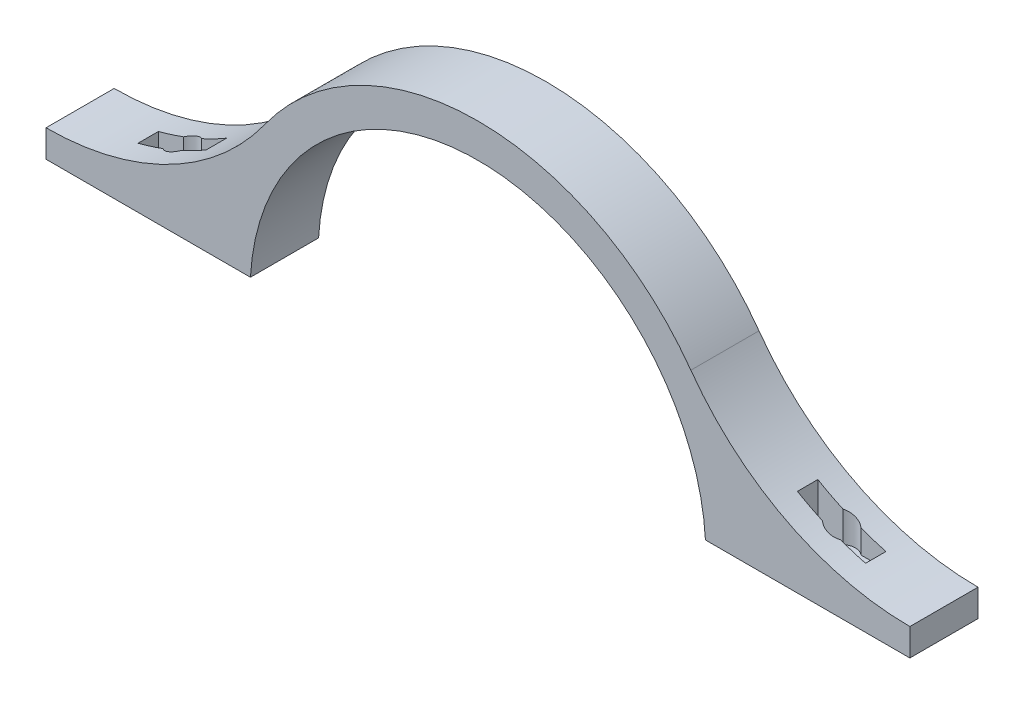
ISO-10303-21;
HEADER;
FILE_DESCRIPTION(('STEP AP214'),'2;1');
FILE_NAME('part.step','',(''),(''),'','','');
FILE_SCHEMA(('AUTOMOTIVE_DESIGN { 1 0 10303 214 1 1 1 1 }'));
ENDSEC;
DATA;
#1=APPLICATION_CONTEXT('core data for automotive mechanical design processes');
#2=APPLICATION_PROTOCOL_DEFINITION('international standard','automotive_design',2000,#1);
#3=PRODUCT_CONTEXT('',#1,'mechanical');
#4=PRODUCT('Part','Part','',(#3));
#5=PRODUCT_RELATED_PRODUCT_CATEGORY('part','',(#4));
#6=PRODUCT_DEFINITION_FORMATION('','',#4);
#7=PRODUCT_DEFINITION_CONTEXT('part definition',#1,'design');
#8=PRODUCT_DEFINITION('design','',#6,#7);
#9=PRODUCT_DEFINITION_SHAPE('','',#8);
#10=(LENGTH_UNIT() NAMED_UNIT(*) SI_UNIT(.MILLI.,.METRE.));
#11=(NAMED_UNIT(*) PLANE_ANGLE_UNIT() SI_UNIT($,.RADIAN.));
#12=(NAMED_UNIT(*) SI_UNIT($,.STERADIAN.) SOLID_ANGLE_UNIT());
#13=UNCERTAINTY_MEASURE_WITH_UNIT(LENGTH_MEASURE(1.E-05),#10,'distance_accuracy_value','');
#14=(GEOMETRIC_REPRESENTATION_CONTEXT(3) GLOBAL_UNCERTAINTY_ASSIGNED_CONTEXT((#13)) GLOBAL_UNIT_ASSIGNED_CONTEXT((#10,
#11,#12)) REPRESENTATION_CONTEXT('',''));
#15=CARTESIAN_POINT('',(0.,0.,0.));
#16=DIRECTION('',(0.,0.,1.));
#17=DIRECTION('',(1.,0.,0.));
#18=AXIS2_PLACEMENT_3D('',#15,#16,#17);
#19=CARTESIAN_POINT('',(119.537512666511,140.657531169831,-16.51));
#20=DIRECTION('',(0.,0.,1.));
#21=DIRECTION('',(1.,0.,0.));
#22=AXIS2_PLACEMENT_3D('',#19,#20,#21);
#23=PLANE('',#22);
#24=DIRECTION('',(0.,-1.,0.));
#25=VECTOR('',#24,1.);
#26=CARTESIAN_POINT('',(110.197616831563,140.657531169831,-16.51));
#27=LINE('',#26,#25);
#28=CARTESIAN_POINT('',(110.197616831563,28.7197108992646,-16.51));
#29=VERTEX_POINT('',#28);
#30=CARTESIAN_POINT('',(110.197616831563,12.3825,-16.51));
#31=VERTEX_POINT('',#30);
#32=EDGE_CURVE('E224',#29,#31,#27,.T.);
#33=ORIENTED_EDGE('',*,*,#32,.T.);
#34=DIRECTION('',(-1.,0.,0.));
#35=VECTOR('',#34,1.);
#36=CARTESIAN_POINT('',(119.53751266651,12.3825,-16.51));
#37=LINE('',#36,#35);
#38=CARTESIAN_POINT('',(119.53751266651,12.3825,-16.51));
#39=VERTEX_POINT('',#38);
#40=EDGE_CURVE('E63',#39,#31,#37,.T.);
#41=ORIENTED_EDGE('',*,*,#40,.F.);
#42=DIRECTION('',(0.,-1.,0.));
#43=VECTOR('',#42,1.);
#44=CARTESIAN_POINT('',(119.537512666511,140.657531169831,-16.51));
#45=LINE('',#44,#43);
#46=CARTESIAN_POINT('',(119.53751266651,23.8809372672632,-16.51));
#47=VERTEX_POINT('',#46);
#48=EDGE_CURVE('E222',#47,#39,#45,.T.);
#49=ORIENTED_EDGE('',*,*,#48,.F.);
#50=CARTESIAN_POINT('',(160.997616831563,115.341456006046,-16.51));
#51=DIRECTION('',(0.,0.,1.));
#52=DIRECTION('',(1.,0.,0.));
#53=AXIS2_PLACEMENT_3D('',#50,#51,#52);
#54=CIRCLE('',#53,100.418956006046);
#55=EDGE_CURVE('E241',#29,#47,#54,.T.);
#56=ORIENTED_EDGE('',*,*,#55,.F.);
#57=EDGE_LOOP('',(#33,#41,#49,#56));
#58=FACE_BOUND('',#57,.T.);
#59=ADVANCED_FACE('F45',(#58),#23,.T.);
#60=CARTESIAN_POINT('',(122.897616831563,140.657531169831,-12.7));
#61=DIRECTION('',(0.,-1.,0.));
#62=DIRECTION('',(1.,0.,0.));
#63=AXIS2_PLACEMENT_3D('',#60,#61,#62);
#64=CYLINDRICAL_SURFACE('',#63,5.08);
#65=ORIENTED_EDGE('',*,*,#48,.T.);
#66=CARTESIAN_POINT('',(122.897616831563,12.3825,-12.7));
#67=DIRECTION('',(0.,1.,0.));
#68=DIRECTION('',(-1.,0.,0.));
#69=AXIS2_PLACEMENT_3D('',#66,#67,#68);
#70=CIRCLE('',#69,5.08);
#71=CARTESIAN_POINT('',(126.257720996615,12.3825,-16.51));
#72=VERTEX_POINT('',#71);
#73=EDGE_CURVE('E207',#72,#39,#70,.T.);
#74=ORIENTED_EDGE('',*,*,#73,.F.);
#75=DIRECTION('',(0.,-1.,0.));
#76=VECTOR('',#75,1.);
#77=CARTESIAN_POINT('',(126.257720996615,140.657531169831,-16.51));
#78=LINE('',#77,#76);
#79=CARTESIAN_POINT('',(126.257720996615,21.1230588496457,-16.51));
#80=VERTEX_POINT('',#79);
#81=EDGE_CURVE('E232',#80,#72,#78,.T.);
#82=ORIENTED_EDGE('',*,*,#81,.F.);
#83=CARTESIAN_POINT('',(119.53751266651,23.8809372672632,-16.51));
#84=CARTESIAN_POINT('',(119.6528062705,23.8286707333009,-16.6116912500721));
#85=CARTESIAN_POINT('',(119.77228731717,23.7747738356047,-16.7077485267733));
#86=CARTESIAN_POINT('',(120.018551607841,23.6642995700594,-16.8881555631376));
#87=CARTESIAN_POINT('',(120.145332182781,23.6077231832867,-16.9725095640966));
#88=CARTESIAN_POINT('',(120.404999819415,23.4925238114805,-17.1290194179637));
#89=CARTESIAN_POINT('',(120.537876766061,23.4339042527195,-17.2011946087971));
#90=CARTESIAN_POINT('',(120.808944695313,23.315050832676,-17.3332035040042));
#91=CARTESIAN_POINT('',(120.947136130544,23.2548168340276,-17.3930361544117));
#92=CARTESIAN_POINT('',(121.227657293804,23.1333198275351,-17.5000145941715));
#93=CARTESIAN_POINT('',(121.36998125154,23.072058300606,-17.5471772121322));
#94=CARTESIAN_POINT('',(121.65802797391,22.9488804576823,-17.6287150189639));
#95=CARTESIAN_POINT('',(121.803751866192,22.8869639282756,-17.6630858992618));
#96=CARTESIAN_POINT('',(122.097630404835,22.7629313648335,-17.7188441201217));
#97=CARTESIAN_POINT('',(122.245785744447,22.7008152781079,-17.7402276892962));
#98=CARTESIAN_POINT('',(122.543510565877,22.5768375344343,-17.7698509475027));
#99=CARTESIAN_POINT('',(122.69308005592,22.5149758789694,-17.778090560032));
#100=CARTESIAN_POINT('',(122.997431406207,22.3899603188079,-17.7813708463908));
#101=CARTESIAN_POINT('',(123.152227129209,22.3268282701136,-17.7759814297694));
#102=CARTESIAN_POINT('',(123.461093703201,22.2017549731794,-17.7510286613946));
#103=CARTESIAN_POINT('',(123.615164792909,22.1398133084905,-17.7314703627436));
#104=CARTESIAN_POINT('',(123.921460957283,22.017543861689,-17.6781826591708));
#105=CARTESIAN_POINT('',(124.073686333861,21.9572158136276,-17.6444556049776));
#106=CARTESIAN_POINT('',(124.375059309526,21.8386153144596,-17.5629127564366));
#107=CARTESIAN_POINT('',(124.524208252259,21.7803419577152,-17.5151032583121));
#108=CARTESIAN_POINT('',(124.814478870931,21.6677090838574,-17.4069529241456));
#109=CARTESIAN_POINT('',(124.955708350065,21.6132874343783,-17.3469663045064));
#110=CARTESIAN_POINT('',(125.2329582259,21.5071447888883,-17.214002380089));
#111=CARTESIAN_POINT('',(125.368979210808,21.4554234876799,-17.1410265474994));
#112=CARTESIAN_POINT('',(125.635004463069,21.3549005124518,-16.9821909449995));
#113=CARTESIAN_POINT('',(125.764990753824,21.306107448891,-16.8962955555703));
#114=CARTESIAN_POINT('',(126.017373887467,21.2119302501394,-16.7122282280297));
#115=CARTESIAN_POINT('',(126.139767180727,21.166547707258,-16.6140506118745));
#116=CARTESIAN_POINT('',(126.257720996615,21.1230588496457,-16.51));
#117=B_SPLINE_CURVE_WITH_KNOTS('',3,(#83,#84,#85,#86,#87,#88,#89,#90,#91,#92,#93,#94,#95,#96,
#97,#98,#99,#100,#101,#102,#103,#104,#105,#106,#107,#108,#109,#110,#111,#112,#113,#114,#115,
#116),.UNSPECIFIED.,.F.,.F.,(4,2,2,2,2,2,2,2,2,2,2,2,2,2,2,2,4),(0.,0.486921444742524,
0.973665964431265,1.45963018977343,1.9456358958824,2.430992850944,2.9165131385768,
3.40217434920488,3.88783838655102,4.38901844662978,4.89001985688624,5.39093817914286,
5.89163288121429,6.37944024613219,6.86719235846185,7.35631473670264,7.84566407647762),.UNSPECIFIED.);
#118=EDGE_CURVE('E230',#47,#80,#117,.T.);
#119=ORIENTED_EDGE('',*,*,#118,.F.);
#120=EDGE_LOOP('',(#65,#74,#82,#119));
#121=FACE_BOUND('',#120,.T.);
#122=ADVANCED_FACE('F228',(#121),#64,.F.);
#123=CARTESIAN_POINT('',(135.597616831563,140.657531169831,-16.51));
#124=DIRECTION('',(0.,0.,1.));
#125=DIRECTION('',(1.,0.,0.));
#126=AXIS2_PLACEMENT_3D('',#123,#124,#125);
#127=PLANE('',#126);
#128=ORIENTED_EDGE('',*,*,#81,.T.);
#129=DIRECTION('',(-1.,0.,0.));
#130=VECTOR('',#129,1.);
#131=CARTESIAN_POINT('',(135.597616831563,12.3825,-16.51));
#132=LINE('',#131,#130);
#133=CARTESIAN_POINT('',(135.597616831563,12.3825,-16.51));
#134=VERTEX_POINT('',#133);
#135=EDGE_CURVE('E211',#134,#72,#132,.T.);
#136=ORIENTED_EDGE('',*,*,#135,.F.);
#137=DIRECTION('',(0.,-1.,0.));
#138=VECTOR('',#137,1.);
#139=CARTESIAN_POINT('',(135.597616831563,140.657531169831,-16.51));
#140=LINE('',#139,#138);
#141=CARTESIAN_POINT('',(135.597616831563,18.1879345807049,-16.51));
#142=VERTEX_POINT('',#141);
#143=EDGE_CURVE('E236',#142,#134,#140,.T.);
#144=ORIENTED_EDGE('',*,*,#143,.F.);
#145=CARTESIAN_POINT('',(160.997616831563,115.341456006046,-16.51));
#146=DIRECTION('',(0.,0.,1.));
#147=DIRECTION('',(1.,0.,0.));
#148=AXIS2_PLACEMENT_3D('',#145,#146,#147);
#149=CIRCLE('',#148,100.418956006046);
#150=EDGE_CURVE('E420',#80,#142,#149,.T.);
#151=ORIENTED_EDGE('',*,*,#150,.F.);
#152=EDGE_LOOP('',(#128,#136,#144,#151));
#153=FACE_BOUND('',#152,.T.);
#154=ADVANCED_FACE('F342',(#153),#127,.T.);
#155=CARTESIAN_POINT('',(135.597616831563,140.657531169831,-8.89));
#156=DIRECTION('',(-1.,0.,0.));
#157=DIRECTION('',(0.,-1.,0.));
#158=AXIS2_PLACEMENT_3D('',#155,#156,#157);
#159=PLANE('',#158);
#160=ORIENTED_EDGE('',*,*,#143,.T.);
#161=DIRECTION('',(0.,0.,-1.));
#162=VECTOR('',#161,1.);
#163=CARTESIAN_POINT('',(135.597616831563,12.3825,-8.89));
#164=LINE('',#163,#162);
#165=CARTESIAN_POINT('',(135.597616831563,12.3825,-8.89));
#166=VERTEX_POINT('',#165);
#167=EDGE_CURVE('E485',#166,#134,#164,.T.);
#168=ORIENTED_EDGE('',*,*,#167,.F.);
#169=DIRECTION('',(0.,-1.,0.));
#170=VECTOR('',#169,1.);
#171=CARTESIAN_POINT('',(135.597616831563,140.657531169831,-8.89));
#172=LINE('',#171,#170);
#173=CARTESIAN_POINT('',(135.597616831563,18.1879345807049,-8.89));
#174=VERTEX_POINT('',#173);
#175=EDGE_CURVE('E479',#174,#166,#172,.T.);
#176=ORIENTED_EDGE('',*,*,#175,.F.);
#177=DIRECTION('',(0.,0.,1.));
#178=VECTOR('',#177,1.);
#179=CARTESIAN_POINT('',(135.597616831563,18.1879345807049,-25.4));
#180=LINE('',#179,#178);
#181=EDGE_CURVE('E486',#142,#174,#180,.T.);
#182=ORIENTED_EDGE('',*,*,#181,.F.);
#183=EDGE_LOOP('',(#160,#168,#176,#182));
#184=FACE_BOUND('',#183,.T.);
#185=ADVANCED_FACE('F449',(#184),#159,.T.);
#186=CARTESIAN_POINT('',(135.597616831563,140.657531169831,-8.89));
#187=DIRECTION('',(0.,0.,-1.));
#188=DIRECTION('',(-1.,0.,0.));
#189=AXIS2_PLACEMENT_3D('',#186,#187,#188);
#190=PLANE('',#189);
#191=ORIENTED_EDGE('',*,*,#175,.T.);
#192=DIRECTION('',(1.,0.,0.));
#193=VECTOR('',#192,1.);
#194=CARTESIAN_POINT('',(126.257720996615,12.3825,-8.88999999999999));
#195=LINE('',#194,#193);
#196=CARTESIAN_POINT('',(126.257720996615,12.3825,-8.88999999999999));
#197=VERTEX_POINT('',#196);
#198=EDGE_CURVE('E493',#197,#166,#195,.T.);
#199=ORIENTED_EDGE('',*,*,#198,.F.);
#200=DIRECTION('',(0.,-1.,0.));
#201=VECTOR('',#200,1.);
#202=CARTESIAN_POINT('',(126.257720996615,140.657531169831,-8.88999999999999));
#203=LINE('',#202,#201);
#204=CARTESIAN_POINT('',(126.257720996615,21.1230588496457,-8.88999999999999));
#205=VERTEX_POINT('',#204);
#206=EDGE_CURVE('E475',#205,#197,#203,.T.);
#207=ORIENTED_EDGE('',*,*,#206,.F.);
#208=CARTESIAN_POINT('',(160.997616831563,115.341456006046,-8.89));
#209=DIRECTION('',(0.,0.,-1.));
#210=DIRECTION('',(-1.,0.,0.));
#211=AXIS2_PLACEMENT_3D('',#208,#209,#210);
#212=CIRCLE('',#211,100.418956006046);
#213=EDGE_CURVE('E439',#174,#205,#212,.T.);
#214=ORIENTED_EDGE('',*,*,#213,.F.);
#215=EDGE_LOOP('',(#191,#199,#207,#214));
#216=FACE_BOUND('',#215,.T.);
#217=ADVANCED_FACE('F445',(#216),#190,.T.);
#218=CARTESIAN_POINT('',(122.897616831563,140.657531169831,-12.7));
#219=DIRECTION('',(0.,-1.,0.));
#220=DIRECTION('',(1.,0.,0.));
#221=AXIS2_PLACEMENT_3D('',#218,#219,#220);
#222=CYLINDRICAL_SURFACE('',#221,5.07999999999997);
#223=ORIENTED_EDGE('',*,*,#206,.T.);
#224=CARTESIAN_POINT('',(122.897616831563,12.3825,-12.7));
#225=DIRECTION('',(0.,1.,0.));
#226=DIRECTION('',(-1.,0.,0.));
#227=AXIS2_PLACEMENT_3D('',#224,#225,#226);
#228=CIRCLE('',#227,5.07999999999997);
#229=CARTESIAN_POINT('',(119.537512666511,12.3825,-8.88999999999999));
#230=VERTEX_POINT('',#229);
#231=EDGE_CURVE('E496',#230,#197,#228,.T.);
#232=ORIENTED_EDGE('',*,*,#231,.F.);
#233=DIRECTION('',(0.,-1.,0.));
#234=VECTOR('',#233,1.);
#235=CARTESIAN_POINT('',(119.537512666511,140.657531169831,-8.88999999999999));
#236=LINE('',#235,#234);
#237=CARTESIAN_POINT('',(119.537512666511,23.8809372672631,-8.89));
#238=VERTEX_POINT('',#237);
#239=EDGE_CURVE('E471',#238,#230,#236,.T.);
#240=ORIENTED_EDGE('',*,*,#239,.F.);
#241=CARTESIAN_POINT('',(126.257720996615,21.1230588496457,-8.89000000000001));
#242=CARTESIAN_POINT('',(126.145067521387,21.1645938655587,-8.79062800391349));
#243=CARTESIAN_POINT('',(126.028364575593,21.2078557386338,-8.6966091594566));
#244=CARTESIAN_POINT('',(125.787972377864,21.297508839939,-8.51975380036328));
#245=CARTESIAN_POINT('',(125.664285849964,21.3438988493528,-8.43691296776302));
#246=CARTESIAN_POINT('',(125.411296347575,21.4393858683487,-8.28302254813655));
#247=CARTESIAN_POINT('',(125.282009645625,21.488475133698,-8.21194135630925));
#248=CARTESIAN_POINT('',(125.018543143085,21.5891607380537,-8.08159393026486));
#249=CARTESIAN_POINT('',(124.884362945897,21.6407572803777,-8.02232865620761));
#250=CARTESIAN_POINT('',(124.612327235406,21.7460573498159,-7.9159157081967));
#251=CARTESIAN_POINT('',(124.474477246924,21.7997577613561,-7.86875084276288));
#252=CARTESIAN_POINT('',(124.195903271491,21.9090041317015,-7.78655159488177));
#253=CARTESIAN_POINT('',(124.055178249984,21.964550759525,-7.75152166350408));
#254=CARTESIAN_POINT('',(123.63007718208,22.1334828892802,-7.66478212002474));
#255=CARTESIAN_POINT('',(123.34267497518,22.2491993440204,-7.63138394969392));
#256=CARTESIAN_POINT('',(122.754162256728,22.489364656871,-7.61308375654575));
#257=CARTESIAN_POINT('',(122.45304952765,22.6139671397022,-7.63056246207118));
#258=CARTESIAN_POINT('',(121.858493312246,22.8633534842084,-7.7183549324548));
#259=CARTESIAN_POINT('',(121.565050055473,22.9881373511947,-7.78867027688726));
#260=CARTESIAN_POINT('',(121.121388956717,23.1791907279347,-7.93771358324265));
#261=CARTESIAN_POINT('',(120.965578104616,23.2467740115168,-7.99875375889591));
#262=CARTESIAN_POINT('',(120.66006556887,23.3801793731107,-8.13625194438336));
#263=CARTESIAN_POINT('',(120.510363891452,23.4460014493275,-8.21270996993028));
#264=CARTESIAN_POINT('',(120.218135837233,23.5753063635422,-8.38082607487781));
#265=CARTESIAN_POINT('',(120.075627348131,23.6387832739168,-8.47251982679957));
#266=CARTESIAN_POINT('',(119.79951928093,23.7624924320543,-8.67047287415083));
#267=CARTESIAN_POINT('',(119.665923056096,23.8227234569233,-8.77673760651897));
#268=CARTESIAN_POINT('',(119.537512666511,23.8809372672632,-8.88999999999999));
#269=B_SPLINE_CURVE_WITH_KNOTS('',3,(#241,#242,#243,#244,#245,#246,#247,#248,#249,#250,#251,
#252,#253,#254,#255,#256,#257,#258,#259,#260,#261,#262,#263,#264,#265,#266,#267,#268),
.UNSPECIFIED.,.F.,.F.,(4,2,2,2,2,2,2,2,2,2,2,2,2,4),(0.,0.467374653731103,0.934568244860329,
1.40048507464395,1.86643974934705,2.3317287131948,2.79718816384608,3.72776850152489,
4.7025839442021,5.67742853057001,6.21819306000122,6.75895814054246,7.30100767170418,
7.84326001356125),.UNSPECIFIED.);
#270=EDGE_CURVE('E429',#205,#238,#269,.T.);
#271=ORIENTED_EDGE('',*,*,#270,.F.);
#272=EDGE_LOOP('',(#223,#232,#240,#271));
#273=FACE_BOUND('',#272,.T.);
#274=ADVANCED_FACE('F441',(#273),#222,.F.);
#275=CARTESIAN_POINT('',(119.537512666511,140.657531169831,-8.88999999999999));
#276=DIRECTION('',(0.,0.,-1.));
#277=DIRECTION('',(-1.,0.,0.));
#278=AXIS2_PLACEMENT_3D('',#275,#276,#277);
#279=PLANE('',#278);
#280=ORIENTED_EDGE('',*,*,#239,.T.);
#281=DIRECTION('',(1.,0.,0.));
#282=VECTOR('',#281,1.);
#283=CARTESIAN_POINT('',(110.197616831563,12.3825,-8.89));
#284=LINE('',#283,#282);
#285=CARTESIAN_POINT('',(110.197616831563,12.3825,-8.89));
#286=VERTEX_POINT('',#285);
#287=EDGE_CURVE('E499',#286,#230,#284,.T.);
#288=ORIENTED_EDGE('',*,*,#287,.F.);
#289=DIRECTION('',(0.,-1.,0.));
#290=VECTOR('',#289,1.);
#291=CARTESIAN_POINT('',(110.197616831563,140.657531169831,-8.88999999999999));
#292=LINE('',#291,#290);
#293=CARTESIAN_POINT('',(110.197616831563,28.7197108992646,-8.89));
#294=VERTEX_POINT('',#293);
#295=EDGE_CURVE('E244',#294,#286,#292,.T.);
#296=ORIENTED_EDGE('',*,*,#295,.F.);
#297=CARTESIAN_POINT('',(160.997616831563,115.341456006046,-8.89));
#298=DIRECTION('',(0.,0.,-1.));
#299=DIRECTION('',(-1.,0.,0.));
#300=AXIS2_PLACEMENT_3D('',#297,#298,#299);
#301=CIRCLE('',#300,100.418956006046);
#302=EDGE_CURVE('E438',#238,#294,#301,.T.);
#303=ORIENTED_EDGE('',*,*,#302,.F.);
#304=EDGE_LOOP('',(#280,#288,#296,#303));
#305=FACE_BOUND('',#304,.T.);
#306=ADVANCED_FACE('F349',(#305),#279,.T.);
#307=CARTESIAN_POINT('',(110.197616831563,140.657531169831,-8.88999999999999));
#308=DIRECTION('',(1.,0.,0.));
#309=DIRECTION('',(0.,1.,0.));
#310=AXIS2_PLACEMENT_3D('',#307,#308,#309);
#311=PLANE('',#310);
#312=ORIENTED_EDGE('',*,*,#295,.T.);
#313=DIRECTION('',(0.,0.,1.));
#314=VECTOR('',#313,1.);
#315=CARTESIAN_POINT('',(110.197616831563,12.3825,-16.51));
#316=LINE('',#315,#314);
#317=EDGE_CURVE('E226',#31,#286,#316,.T.);
#318=ORIENTED_EDGE('',*,*,#317,.F.);
#319=ORIENTED_EDGE('',*,*,#32,.F.);
#320=DIRECTION('',(0.,0.,1.));
#321=VECTOR('',#320,1.);
#322=CARTESIAN_POINT('',(110.197616831563,28.7197108992646,-25.4));
#323=LINE('',#322,#321);
#324=EDGE_CURVE('E264',#294,#29,#323,.F.);
#325=ORIENTED_EDGE('',*,*,#324,.F.);
#326=EDGE_LOOP('',(#312,#318,#319,#325));
#327=FACE_BOUND('',#326,.T.);
#328=ADVANCED_FACE('F335',(#327),#311,.T.);
#329=CARTESIAN_POINT('',(-110.197616831563,97.63225,-8.88999999999999));
#330=DIRECTION('',(1.,0.,0.));
#331=DIRECTION('',(0.,1.,0.));
#332=AXIS2_PLACEMENT_3D('',#329,#330,#331);
#333=PLANE('',#332);
#334=DIRECTION('',(0.,0.,1.));
#335=VECTOR('',#334,1.);
#336=CARTESIAN_POINT('',(-110.197616831563,12.3825,-16.51));
#337=LINE('',#336,#335);
#338=CARTESIAN_POINT('',(-110.197616831563,12.3825,-16.51));
#339=VERTEX_POINT('',#338);
#340=CARTESIAN_POINT('',(-110.197616831563,12.3825,-8.89));
#341=VERTEX_POINT('',#340);
#342=EDGE_CURVE('E385',#339,#341,#337,.T.);
#343=ORIENTED_EDGE('',*,*,#342,.T.);
#344=DIRECTION('',(0.,-1.,0.));
#345=VECTOR('',#344,1.);
#346=CARTESIAN_POINT('',(-110.197616831563,97.63225,-8.88999999999999));
#347=LINE('',#346,#345);
#348=CARTESIAN_POINT('',(-110.197616831563,28.7197108992646,-8.89));
#349=VERTEX_POINT('',#348);
#350=EDGE_CURVE('E274',#349,#341,#347,.T.);
#351=ORIENTED_EDGE('',*,*,#350,.F.);
#352=DIRECTION('',(0.,0.,1.));
#353=VECTOR('',#352,1.);
#354=CARTESIAN_POINT('',(-110.197616831563,28.7197108992646,-25.4));
#355=LINE('',#354,#353);
#356=CARTESIAN_POINT('',(-110.197616831563,28.7197108992646,-16.51));
#357=VERTEX_POINT('',#356);
#358=EDGE_CURVE('E878',#349,#357,#355,.F.);
#359=ORIENTED_EDGE('',*,*,#358,.T.);
#360=DIRECTION('',(0.,-1.,0.));
#361=VECTOR('',#360,1.);
#362=CARTESIAN_POINT('',(-110.197616831563,97.63225,-16.51));
#363=LINE('',#362,#361);
#364=EDGE_CURVE('E528',#357,#339,#363,.T.);
#365=ORIENTED_EDGE('',*,*,#364,.T.);
#366=EDGE_LOOP('',(#343,#351,#359,#365));
#367=FACE_BOUND('',#366,.T.);
#368=ADVANCED_FACE('F304',(#367),#333,.F.);
#369=CARTESIAN_POINT('',(-119.537512666511,97.63225,-16.51));
#370=DIRECTION('',(0.,0.,-1.));
#371=DIRECTION('',(-1.,0.,0.));
#372=AXIS2_PLACEMENT_3D('',#369,#370,#371);
#373=PLANE('',#372);
#374=DIRECTION('',(1.,0.,0.));
#375=VECTOR('',#374,1.);
#376=CARTESIAN_POINT('',(-119.53751266651,12.3825,-16.51));
#377=LINE('',#376,#375);
#378=CARTESIAN_POINT('',(-119.53751266651,12.3825,-16.51));
#379=VERTEX_POINT('',#378);
#380=EDGE_CURVE('E71',#379,#339,#377,.T.);
#381=ORIENTED_EDGE('',*,*,#380,.T.);
#382=ORIENTED_EDGE('',*,*,#364,.F.);
#383=CARTESIAN_POINT('',(-160.997616831563,115.341456006046,-16.51));
#384=DIRECTION('',(0.,0.,-1.));
#385=DIRECTION('',(-1.,0.,0.));
#386=AXIS2_PLACEMENT_3D('',#383,#384,#385);
#387=CIRCLE('',#386,100.418956006046);
#388=CARTESIAN_POINT('',(-119.53751266651,23.8809372672632,-16.51));
#389=VERTEX_POINT('',#388);
#390=EDGE_CURVE('E321',#357,#389,#387,.T.);
#391=ORIENTED_EDGE('',*,*,#390,.T.);
#392=DIRECTION('',(0.,-1.,0.));
#393=VECTOR('',#392,1.);
#394=CARTESIAN_POINT('',(-119.537512666511,97.63225,-16.51));
#395=LINE('',#394,#393);
#396=EDGE_CURVE('E532',#389,#379,#395,.T.);
#397=ORIENTED_EDGE('',*,*,#396,.T.);
#398=EDGE_LOOP('',(#381,#382,#391,#397));
#399=FACE_BOUND('',#398,.T.);
#400=ADVANCED_FACE('F328',(#399),#373,.F.);
#401=CARTESIAN_POINT('',(-122.897616831563,97.63225,-12.7));
#402=DIRECTION('',(0.,-1.,0.));
#403=DIRECTION('',(1.,0.,0.));
#404=AXIS2_PLACEMENT_3D('',#401,#402,#403);
#405=CYLINDRICAL_SURFACE('',#404,5.08);
#406=CARTESIAN_POINT('',(-122.897616831563,12.3825,-12.7));
#407=DIRECTION('',(0.,-1.,0.));
#408=DIRECTION('',(1.,0.,0.));
#409=AXIS2_PLACEMENT_3D('',#406,#407,#408);
#410=CIRCLE('',#409,5.08);
#411=CARTESIAN_POINT('',(-126.257720996615,12.3825,-16.51));
#412=VERTEX_POINT('',#411);
#413=EDGE_CURVE('E408',#412,#379,#410,.T.);
#414=ORIENTED_EDGE('',*,*,#413,.T.);
#415=ORIENTED_EDGE('',*,*,#396,.F.);
#416=CARTESIAN_POINT('',(-119.53751266651,23.8809372672632,-16.51));
#417=CARTESIAN_POINT('',(-119.6528062705,23.8286707333009,-16.6116912500721));
#418=CARTESIAN_POINT('',(-119.77228731717,23.7747738356047,-16.7077485267733));
#419=CARTESIAN_POINT('',(-120.018551607841,23.6642995700594,-16.8881555631376));
#420=CARTESIAN_POINT('',(-120.145332182781,23.6077231832867,-16.9725095640966));
#421=CARTESIAN_POINT('',(-120.404999819415,23.4925238114805,-17.1290194179637));
#422=CARTESIAN_POINT('',(-120.537876766061,23.4339042527195,-17.2011946087971));
#423=CARTESIAN_POINT('',(-120.808944695313,23.315050832676,-17.3332035040042));
#424=CARTESIAN_POINT('',(-120.947136130544,23.2548168340276,-17.3930361544117));
#425=CARTESIAN_POINT('',(-121.227657293804,23.1333198275351,-17.5000145941715));
#426=CARTESIAN_POINT('',(-121.36998125154,23.072058300606,-17.5471772121322));
#427=CARTESIAN_POINT('',(-121.65802797391,22.9488804576823,-17.6287150189639));
#428=CARTESIAN_POINT('',(-121.803751866193,22.8869639282756,-17.6630858992618));
#429=CARTESIAN_POINT('',(-122.097630404835,22.7629313648335,-17.7188441201217));
#430=CARTESIAN_POINT('',(-122.245785744447,22.7008152781079,-17.7402276892962));
#431=CARTESIAN_POINT('',(-122.543510565877,22.5768375344343,-17.7698509475027));
#432=CARTESIAN_POINT('',(-122.69308005592,22.5149758789694,-17.778090560032));
#433=CARTESIAN_POINT('',(-122.997431406207,22.3899603188079,-17.7813708463908));
#434=CARTESIAN_POINT('',(-123.152227129209,22.3268282701136,-17.7759814297694));
#435=CARTESIAN_POINT('',(-123.461093703201,22.2017549731794,-17.7510286613946));
#436=CARTESIAN_POINT('',(-123.615164792909,22.1398133084905,-17.7314703627436));
#437=CARTESIAN_POINT('',(-123.921460957283,22.017543861689,-17.6781826591708));
#438=CARTESIAN_POINT('',(-124.073686333861,21.9572158136276,-17.6444556049776));
#439=CARTESIAN_POINT('',(-124.375059309526,21.8386153144596,-17.5629127564366));
#440=CARTESIAN_POINT('',(-124.524208252259,21.7803419577152,-17.5151032583121));
#441=CARTESIAN_POINT('',(-124.814478870931,21.6677090838574,-17.4069529241456));
#442=CARTESIAN_POINT('',(-124.955708350065,21.6132874343783,-17.3469663045064));
#443=CARTESIAN_POINT('',(-125.2329582259,21.5071447888883,-17.214002380089));
#444=CARTESIAN_POINT('',(-125.368979210808,21.4554234876799,-17.1410265474994));
#445=CARTESIAN_POINT('',(-125.635004463069,21.3549005124518,-16.9821909449995));
#446=CARTESIAN_POINT('',(-125.764990753824,21.306107448891,-16.8962955555703));
#447=CARTESIAN_POINT('',(-126.017373887467,21.2119302501394,-16.7122282280297));
#448=CARTESIAN_POINT('',(-126.139767180727,21.166547707258,-16.6140506118745));
#449=CARTESIAN_POINT('',(-126.257720996615,21.1230588496457,-16.51));
#450=B_SPLINE_CURVE_WITH_KNOTS('',3,(#416,#417,#418,#419,#420,#421,#422,#423,#424,#425,#426,
#427,#428,#429,#430,#431,#432,#433,#434,#435,#436,#437,#438,#439,#440,#441,#442,#443,#444,#445,
#446,#447,#448,#449),.UNSPECIFIED.,.F.,.F.,(4,2,2,2,2,2,2,2,2,2,2,2,2,2,2,2,4),(0.,
0.486921444742539,0.973665964431274,1.45963018977345,1.9456358958824,2.430992850944,
2.91651313857681,3.40217434920486,3.88783838655101,4.38901844662979,4.89001985688623,
5.39093817914286,5.89163288121428,6.37944024613219,6.86719235846184,7.35631473670266,
7.84566407647764),.UNSPECIFIED.);
#451=CARTESIAN_POINT('',(-126.257720996615,21.1230588496457,-16.51));
#452=VERTEX_POINT('',#451);
#453=EDGE_CURVE('E310',#389,#452,#450,.T.);
#454=ORIENTED_EDGE('',*,*,#453,.T.);
#455=DIRECTION('',(0.,-1.,0.));
#456=VECTOR('',#455,1.);
#457=CARTESIAN_POINT('',(-126.257720996615,97.63225,-16.51));
#458=LINE('',#457,#456);
#459=EDGE_CURVE('E534',#452,#412,#458,.T.);
#460=ORIENTED_EDGE('',*,*,#459,.T.);
#461=EDGE_LOOP('',(#414,#415,#454,#460));
#462=FACE_BOUND('',#461,.T.);
#463=ADVANCED_FACE('F323',(#462),#405,.F.);
#464=CARTESIAN_POINT('',(-135.597616831563,97.63225,-16.51));
#465=DIRECTION('',(0.,0.,-1.));
#466=DIRECTION('',(-1.,0.,0.));
#467=AXIS2_PLACEMENT_3D('',#464,#465,#466);
#468=PLANE('',#467);
#469=DIRECTION('',(1.,0.,0.));
#470=VECTOR('',#469,1.);
#471=CARTESIAN_POINT('',(-135.597616831563,12.3825,-16.51));
#472=LINE('',#471,#470);
#473=CARTESIAN_POINT('',(-135.597616831563,12.3825,-16.51));
#474=VERTEX_POINT('',#473);
#475=EDGE_CURVE('E405',#474,#412,#472,.T.);
#476=ORIENTED_EDGE('',*,*,#475,.T.);
#477=ORIENTED_EDGE('',*,*,#459,.F.);
#478=CARTESIAN_POINT('',(-160.997616831563,115.341456006046,-16.51));
#479=DIRECTION('',(0.,0.,-1.));
#480=DIRECTION('',(-1.,0.,0.));
#481=AXIS2_PLACEMENT_3D('',#478,#479,#480);
#482=CIRCLE('',#481,100.418956006046);
#483=CARTESIAN_POINT('',(-135.597616831563,18.1879345807049,-16.51));
#484=VERTEX_POINT('',#483);
#485=EDGE_CURVE('E320',#452,#484,#482,.T.);
#486=ORIENTED_EDGE('',*,*,#485,.T.);
#487=DIRECTION('',(0.,-1.,0.));
#488=VECTOR('',#487,1.);
#489=CARTESIAN_POINT('',(-135.597616831563,97.63225,-16.51));
#490=LINE('',#489,#488);
#491=EDGE_CURVE('E541',#484,#474,#490,.T.);
#492=ORIENTED_EDGE('',*,*,#491,.T.);
#493=EDGE_LOOP('',(#476,#477,#486,#492));
#494=FACE_BOUND('',#493,.T.);
#495=ADVANCED_FACE('F327',(#494),#468,.F.);
#496=CARTESIAN_POINT('',(-135.597616831563,97.63225,-8.89));
#497=DIRECTION('',(-1.,0.,0.));
#498=DIRECTION('',(0.,-1.,0.));
#499=AXIS2_PLACEMENT_3D('',#496,#497,#498);
#500=PLANE('',#499);
#501=DIRECTION('',(0.,0.,-1.));
#502=VECTOR('',#501,1.);
#503=CARTESIAN_POINT('',(-135.597616831563,12.3825,-8.89));
#504=LINE('',#503,#502);
#505=CARTESIAN_POINT('',(-135.597616831563,12.3825,-8.89));
#506=VERTEX_POINT('',#505);
#507=EDGE_CURVE('E399',#506,#474,#504,.T.);
#508=ORIENTED_EDGE('',*,*,#507,.T.);
#509=ORIENTED_EDGE('',*,*,#491,.F.);
#510=DIRECTION('',(0.,0.,1.));
#511=VECTOR('',#510,1.);
#512=CARTESIAN_POINT('',(-135.597616831563,18.1879345807049,-25.4));
#513=LINE('',#512,#511);
#514=CARTESIAN_POINT('',(-135.597616831563,18.1879345807049,-8.88999999999999));
#515=VERTEX_POINT('',#514);
#516=EDGE_CURVE('E887',#484,#515,#513,.T.);
#517=ORIENTED_EDGE('',*,*,#516,.T.);
#518=DIRECTION('',(0.,-1.,0.));
#519=VECTOR('',#518,1.);
#520=CARTESIAN_POINT('',(-135.597616831563,97.63225,-8.89));
#521=LINE('',#520,#519);
#522=EDGE_CURVE('E549',#515,#506,#521,.T.);
#523=ORIENTED_EDGE('',*,*,#522,.T.);
#524=EDGE_LOOP('',(#508,#509,#517,#523));
#525=FACE_BOUND('',#524,.T.);
#526=ADVANCED_FACE('F782',(#525),#500,.F.);
#527=CARTESIAN_POINT('',(-135.597616831563,97.63225,-8.89));
#528=DIRECTION('',(0.,0.,1.));
#529=DIRECTION('',(1.,0.,0.));
#530=AXIS2_PLACEMENT_3D('',#527,#528,#529);
#531=PLANE('',#530);
#532=DIRECTION('',(-1.,0.,0.));
#533=VECTOR('',#532,1.);
#534=CARTESIAN_POINT('',(-126.257720996615,12.3825,-8.88999999999999));
#535=LINE('',#534,#533);
#536=CARTESIAN_POINT('',(-126.257720996615,12.3825,-8.88999999999999));
#537=VERTEX_POINT('',#536);
#538=EDGE_CURVE('E395',#537,#506,#535,.T.);
#539=ORIENTED_EDGE('',*,*,#538,.T.);
#540=ORIENTED_EDGE('',*,*,#522,.F.);
#541=CARTESIAN_POINT('',(-160.997616831563,115.341456006046,-8.89));
#542=DIRECTION('',(0.,0.,1.));
#543=DIRECTION('',(1.,0.,0.));
#544=AXIS2_PLACEMENT_3D('',#541,#542,#543);
#545=CIRCLE('',#544,100.418956006046);
#546=CARTESIAN_POINT('',(-126.257720996615,21.1230588496458,-8.88999999999999));
#547=VERTEX_POINT('',#546);
#548=EDGE_CURVE('E295',#515,#547,#545,.T.);
#549=ORIENTED_EDGE('',*,*,#548,.T.);
#550=DIRECTION('',(0.,-1.,0.));
#551=VECTOR('',#550,1.);
#552=CARTESIAN_POINT('',(-126.257720996615,97.63225,-8.88999999999999));
#553=LINE('',#552,#551);
#554=EDGE_CURVE('E391',#547,#537,#553,.T.);
#555=ORIENTED_EDGE('',*,*,#554,.T.);
#556=EDGE_LOOP('',(#539,#540,#549,#555));
#557=FACE_BOUND('',#556,.T.);
#558=ADVANCED_FACE('F370',(#557),#531,.F.);
#559=CARTESIAN_POINT('',(-122.897616831563,97.63225,-12.7));
#560=DIRECTION('',(0.,-1.,0.));
#561=DIRECTION('',(1.,0.,0.));
#562=AXIS2_PLACEMENT_3D('',#559,#560,#561);
#563=CYLINDRICAL_SURFACE('',#562,5.07999999999997);
#564=CARTESIAN_POINT('',(-122.897616831563,12.3825,-12.7));
#565=DIRECTION('',(0.,-1.,0.));
#566=DIRECTION('',(1.,0.,0.));
#567=AXIS2_PLACEMENT_3D('',#564,#565,#566);
#568=CIRCLE('',#567,5.07999999999997);
#569=CARTESIAN_POINT('',(-119.537512666511,12.3825,-8.88999999999999));
#570=VERTEX_POINT('',#569);
#571=EDGE_CURVE('E384',#570,#537,#568,.T.);
#572=ORIENTED_EDGE('',*,*,#571,.T.);
#573=ORIENTED_EDGE('',*,*,#554,.F.);
#574=CARTESIAN_POINT('',(-126.257720996615,21.1230588496458,-8.88999999999999));
#575=CARTESIAN_POINT('',(-126.145067521387,21.1645938655587,-8.79062800391347));
#576=CARTESIAN_POINT('',(-126.028364575593,21.2078557386339,-8.69660915945658));
#577=CARTESIAN_POINT('',(-125.787972377864,21.297508839939,-8.51975380036325));
#578=CARTESIAN_POINT('',(-125.664285849964,21.3438988493528,-8.436912967763));
#579=CARTESIAN_POINT('',(-125.411296347575,21.4393858683488,-8.28302254813654));
#580=CARTESIAN_POINT('',(-125.282009645625,21.4884751336981,-8.21194135630924));
#581=CARTESIAN_POINT('',(-125.018543143085,21.5891607380537,-8.08159393026486));
#582=CARTESIAN_POINT('',(-124.884362945897,21.6407572803777,-8.02232865620759));
#583=CARTESIAN_POINT('',(-124.612327235405,21.7460573498159,-7.91591570819668));
#584=CARTESIAN_POINT('',(-124.474477246924,21.7997577613562,-7.86875084276287));
#585=CARTESIAN_POINT('',(-124.195903271491,21.9090041317015,-7.78655159488176));
#586=CARTESIAN_POINT('',(-124.055178249983,21.964550759525,-7.75152166350408));
#587=CARTESIAN_POINT('',(-123.63007718208,22.1334828892802,-7.66478212002473));
#588=CARTESIAN_POINT('',(-123.34267497518,22.2491993440204,-7.63138394969391));
#589=CARTESIAN_POINT('',(-122.754162256728,22.4893646568711,-7.61308375654575));
#590=CARTESIAN_POINT('',(-122.45304952765,22.6139671397022,-7.63056246207119));
#591=CARTESIAN_POINT('',(-121.858493312246,22.8633534842084,-7.71835493245481));
#592=CARTESIAN_POINT('',(-121.565050055473,22.9881373511947,-7.78867027688727));
#593=CARTESIAN_POINT('',(-121.121388956717,23.1791907279347,-7.93771358324267));
#594=CARTESIAN_POINT('',(-120.965578104616,23.2467740115168,-7.99875375889593));
#595=CARTESIAN_POINT('',(-120.66006556887,23.3801793731107,-8.13625194438337));
#596=CARTESIAN_POINT('',(-120.510363891452,23.4460014493275,-8.21270996993029));
#597=CARTESIAN_POINT('',(-120.218135837233,23.5753063635422,-8.38082607487782));
#598=CARTESIAN_POINT('',(-120.075627348131,23.6387832739168,-8.47251982679958));
#599=CARTESIAN_POINT('',(-119.79951928093,23.7624924320543,-8.67047287415084));
#600=CARTESIAN_POINT('',(-119.665923056096,23.8227234569233,-8.77673760651898));
#601=CARTESIAN_POINT('',(-119.537512666511,23.8809372672632,-8.88999999999999));
#602=B_SPLINE_CURVE_WITH_KNOTS('',3,(#574,#575,#576,#577,#578,#579,#580,#581,#582,#583,#584,
#585,#586,#587,#588,#589,#590,#591,#592,#593,#594,#595,#596,#597,#598,#599,#600,#601),
.UNSPECIFIED.,.F.,.F.,(4,2,2,2,2,2,2,2,2,2,2,2,2,4),(0.,0.467374653731108,0.934568244860335,
1.40048507464395,1.86643974934705,2.3317287131948,2.79718816384609,3.72776850152489,
4.70258394420211,5.67742853057002,6.21819306000122,6.75895814054245,7.30100767170417,
7.84326001356122),.UNSPECIFIED.);
#603=CARTESIAN_POINT('',(-119.537512666511,23.8809372672632,-8.89));
#604=VERTEX_POINT('',#603);
#605=EDGE_CURVE('E285',#547,#604,#602,.T.);
#606=ORIENTED_EDGE('',*,*,#605,.T.);
#607=DIRECTION('',(0.,-1.,0.));
#608=VECTOR('',#607,1.);
#609=CARTESIAN_POINT('',(-119.537512666511,97.63225,-8.88999999999999));
#610=LINE('',#609,#608);
#611=EDGE_CURVE('E377',#604,#570,#610,.T.);
#612=ORIENTED_EDGE('',*,*,#611,.T.);
#613=EDGE_LOOP('',(#572,#573,#606,#612));
#614=FACE_BOUND('',#613,.T.);
#615=ADVANCED_FACE('F297',(#614),#563,.F.);
#616=CARTESIAN_POINT('',(-119.537512666511,97.63225,-8.88999999999999));
#617=DIRECTION('',(0.,0.,1.));
#618=DIRECTION('',(1.,0.,0.));
#619=AXIS2_PLACEMENT_3D('',#616,#617,#618);
#620=PLANE('',#619);
#621=DIRECTION('',(-1.,0.,0.));
#622=VECTOR('',#621,1.);
#623=CARTESIAN_POINT('',(-110.197616831563,12.3825,-8.89));
#624=LINE('',#623,#622);
#625=EDGE_CURVE('E374',#341,#570,#624,.T.);
#626=ORIENTED_EDGE('',*,*,#625,.T.);
#627=ORIENTED_EDGE('',*,*,#611,.F.);
#628=CARTESIAN_POINT('',(-160.997616831563,115.341456006046,-8.89));
#629=DIRECTION('',(0.,0.,1.));
#630=DIRECTION('',(1.,0.,0.));
#631=AXIS2_PLACEMENT_3D('',#628,#629,#630);
#632=CIRCLE('',#631,100.418956006046);
#633=EDGE_CURVE('E390',#604,#349,#632,.T.);
#634=ORIENTED_EDGE('',*,*,#633,.T.);
#635=ORIENTED_EDGE('',*,*,#350,.T.);
#636=EDGE_LOOP('',(#626,#627,#634,#635));
#637=FACE_BOUND('',#636,.T.);
#638=ADVANCED_FACE('F363',(#637),#620,.F.);
#639=CARTESIAN_POINT('',(160.997616831563,115.341456006046,-25.4));
#640=DIRECTION('',(0.,0.,1.));
#641=DIRECTION('',(1.,0.,0.));
#642=AXIS2_PLACEMENT_3D('',#639,#640,#641);
#643=CYLINDRICAL_SURFACE('',#642,100.418956006046);
#644=CARTESIAN_POINT('',(160.997616831563,115.341456006046,0.));
#645=DIRECTION('',(0.,0.,-1.));
#646=DIRECTION('',(-1.,0.,0.));
#647=AXIS2_PLACEMENT_3D('',#644,#645,#646);
#648=CIRCLE('',#647,100.418956006046);
#649=CARTESIAN_POINT('',(160.997616831563,14.9225,0.));
#650=VERTEX_POINT('',#649);
#651=CARTESIAN_POINT('',(79.3657269803932,56.8589690148896,0.));
#652=VERTEX_POINT('',#651);
#653=EDGE_CURVE('E259',#650,#652,#648,.T.);
#654=ORIENTED_EDGE('',*,*,#653,.F.);
#655=DIRECTION('',(0.,0.,1.));
#656=VECTOR('',#655,1.);
#657=CARTESIAN_POINT('',(160.997616831563,14.9225,-25.4));
#658=LINE('',#657,#656);
#659=CARTESIAN_POINT('',(160.997616831563,14.9225,-25.4));
#660=VERTEX_POINT('',#659);
#661=EDGE_CURVE('E271',#660,#650,#658,.T.);
#662=ORIENTED_EDGE('',*,*,#661,.F.);
#663=CARTESIAN_POINT('',(160.997616831563,115.341456006046,-25.4));
#664=DIRECTION('',(0.,0.,-1.));
#665=DIRECTION('',(-1.,0.,0.));
#666=AXIS2_PLACEMENT_3D('',#663,#664,#665);
#667=CIRCLE('',#666,100.418956006046);
#668=CARTESIAN_POINT('',(79.3657269803932,56.8589690148896,-25.4));
#669=VERTEX_POINT('',#668);
#670=EDGE_CURVE('E245',#660,#669,#667,.T.);
#671=ORIENTED_EDGE('',*,*,#670,.T.);
#672=DIRECTION('',(0.,0.,1.));
#673=VECTOR('',#672,1.);
#674=CARTESIAN_POINT('',(79.3657269803932,56.8589690148896,-25.4));
#675=LINE('',#674,#673);
#676=EDGE_CURVE('E258',#669,#652,#675,.T.);
#677=ORIENTED_EDGE('',*,*,#676,.T.);
#678=EDGE_LOOP('',(#654,#662,#671,#677));
#679=FACE_BOUND('',#678,.T.);
#680=ORIENTED_EDGE('',*,*,#324,.T.);
#681=ORIENTED_EDGE('',*,*,#55,.T.);
#682=ORIENTED_EDGE('',*,*,#118,.T.);
#683=ORIENTED_EDGE('',*,*,#150,.T.);
#684=ORIENTED_EDGE('',*,*,#181,.T.);
#685=ORIENTED_EDGE('',*,*,#213,.T.);
#686=ORIENTED_EDGE('',*,*,#270,.T.);
#687=ORIENTED_EDGE('',*,*,#302,.T.);
#688=EDGE_LOOP('',(#680,#681,#682,#683,#684,#685,#686,#687));
#689=FACE_BOUND('',#688,.T.);
#690=ADVANCED_FACE('F360',(#679,#689),#643,.F.);
#691=CARTESIAN_POINT('',(0.,4.7625,-25.4));
#692=DIRECTION('',(0.,-1.,0.));
#693=DIRECTION('',(1.,0.,0.));
#694=AXIS2_PLACEMENT_3D('',#691,#692,#693);
#695=PLANE('',#694);
#696=DIRECTION('',(1.,0.,0.));
#697=VECTOR('',#696,1.);
#698=CARTESIAN_POINT('',(0.,4.7625,0.));
#699=LINE('',#698,#697);
#700=CARTESIAN_POINT('',(84.7976168315625,4.76249999999999,0.));
#701=VERTEX_POINT('',#700);
#702=CARTESIAN_POINT('',(160.997616831563,4.76249999999998,0.));
#703=VERTEX_POINT('',#702);
#704=EDGE_CURVE('E263',#701,#703,#699,.T.);
#705=ORIENTED_EDGE('',*,*,#704,.F.);
#706=DIRECTION('',(0.,0.,1.));
#707=VECTOR('',#706,1.);
#708=CARTESIAN_POINT('',(84.7976168315625,4.76249999999999,-25.4));
#709=LINE('',#708,#707);
#710=CARTESIAN_POINT('',(84.7976168315625,4.76249999999999,-25.4));
#711=VERTEX_POINT('',#710);
#712=EDGE_CURVE('E278',#711,#701,#709,.T.);
#713=ORIENTED_EDGE('',*,*,#712,.F.);
#714=DIRECTION('',(1.,0.,0.));
#715=VECTOR('',#714,1.);
#716=CARTESIAN_POINT('',(0.,4.7625,-25.4));
#717=LINE('',#716,#715);
#718=CARTESIAN_POINT('',(160.997616831563,4.76249999999998,-25.4));
#719=VERTEX_POINT('',#718);
#720=EDGE_CURVE('E249',#711,#719,#717,.T.);
#721=ORIENTED_EDGE('',*,*,#720,.T.);
#722=DIRECTION('',(0.,0.,1.));
#723=VECTOR('',#722,1.);
#724=CARTESIAN_POINT('',(160.997616831563,4.76249999999998,-25.4));
#725=LINE('',#724,#723);
#726=EDGE_CURVE('E275',#719,#703,#725,.T.);
#727=ORIENTED_EDGE('',*,*,#726,.T.);
#728=EDGE_LOOP('',(#705,#713,#721,#727));
#729=FACE_BOUND('',#728,.T.);
#730=CARTESIAN_POINT('',(122.897616831563,4.76250000000002,-12.7));
#731=DIRECTION('',(0.,1.,0.));
#732=DIRECTION('',(-1.,0.,0.));
#733=AXIS2_PLACEMENT_3D('',#730,#731,#732);
#734=CIRCLE('',#733,2.15899999999999);
#735=CARTESIAN_POINT('',(120.738616831563,4.76250000000002,-12.7));
#736=VERTEX_POINT('',#735);
#737=EDGE_CURVE('E505',#736,#736,#734,.T.);
#738=ORIENTED_EDGE('',*,*,#737,.T.);
#739=EDGE_LOOP('',(#738));
#740=FACE_BOUND('',#739,.T.);
#741=ADVANCED_FACE('F357',(#729,#740),#695,.T.);
#742=CARTESIAN_POINT('',(-160.997616831563,115.341456006046,-25.4));
#743=DIRECTION('',(0.,0.,1.));
#744=DIRECTION('',(1.,0.,0.));
#745=AXIS2_PLACEMENT_3D('',#742,#743,#744);
#746=CYLINDRICAL_SURFACE('',#745,100.418956006046);
#747=ORIENTED_EDGE('',*,*,#390,.F.);
#748=ORIENTED_EDGE('',*,*,#358,.F.);
#749=ORIENTED_EDGE('',*,*,#633,.F.);
#750=ORIENTED_EDGE('',*,*,#605,.F.);
#751=ORIENTED_EDGE('',*,*,#548,.F.);
#752=ORIENTED_EDGE('',*,*,#516,.F.);
#753=ORIENTED_EDGE('',*,*,#485,.F.);
#754=ORIENTED_EDGE('',*,*,#453,.F.);
#755=EDGE_LOOP('',(#747,#748,#749,#750,#751,#752,#753,#754));
#756=FACE_BOUND('',#755,.T.);
#757=CARTESIAN_POINT('',(-160.997616831563,115.341456006046,0.));
#758=DIRECTION('',(0.,0.,1.));
#759=DIRECTION('',(1.,0.,0.));
#760=AXIS2_PLACEMENT_3D('',#757,#758,#759);
#761=CIRCLE('',#760,100.418956006046);
#762=CARTESIAN_POINT('',(-160.997616831563,14.9225,0.));
#763=VERTEX_POINT('',#762);
#764=CARTESIAN_POINT('',(-79.3657269803932,56.8589690148896,0.));
#765=VERTEX_POINT('',#764);
#766=EDGE_CURVE('E294',#763,#765,#761,.T.);
#767=ORIENTED_EDGE('',*,*,#766,.T.);
#768=DIRECTION('',(0.,0.,1.));
#769=VECTOR('',#768,1.);
#770=CARTESIAN_POINT('',(-79.3657269803932,56.8589690148896,-25.4));
#771=LINE('',#770,#769);
#772=CARTESIAN_POINT('',(-79.3657269803932,56.8589690148896,-25.4));
#773=VERTEX_POINT('',#772);
#774=EDGE_CURVE('E11',#773,#765,#771,.T.);
#775=ORIENTED_EDGE('',*,*,#774,.F.);
#776=CARTESIAN_POINT('',(-160.997616831563,115.341456006046,-25.4));
#777=DIRECTION('',(0.,0.,1.));
#778=DIRECTION('',(1.,0.,0.));
#779=AXIS2_PLACEMENT_3D('',#776,#777,#778);
#780=CIRCLE('',#779,100.418956006046);
#781=CARTESIAN_POINT('',(-160.997616831563,14.9225,-25.4));
#782=VERTEX_POINT('',#781);
#783=EDGE_CURVE('E557',#782,#773,#780,.T.);
#784=ORIENTED_EDGE('',*,*,#783,.F.);
#785=DIRECTION('',(0.,0.,1.));
#786=VECTOR('',#785,1.);
#787=CARTESIAN_POINT('',(-160.997616831563,14.9225,-25.4));
#788=LINE('',#787,#786);
#789=EDGE_CURVE('E49',#782,#763,#788,.T.);
#790=ORIENTED_EDGE('',*,*,#789,.T.);
#791=EDGE_LOOP('',(#767,#775,#784,#790));
#792=FACE_BOUND('',#791,.T.);
#793=ADVANCED_FACE('F47',(#756,#792),#746,.F.);
#794=CARTESIAN_POINT('',(0.,0.,-25.4));
#795=DIRECTION('',(0.,0.,1.));
#796=DIRECTION('',(1.,0.,0.));
#797=AXIS2_PLACEMENT_3D('',#794,#795,#796);
#798=CYLINDRICAL_SURFACE('',#797,97.63125);
#799=CARTESIAN_POINT('',(0.,0.,0.));
#800=DIRECTION('',(0.,0.,1.));
#801=DIRECTION('',(1.,0.,0.));
#802=AXIS2_PLACEMENT_3D('',#799,#800,#801);
#803=CIRCLE('',#802,97.63125);
#804=EDGE_CURVE('E561',#652,#765,#803,.T.);
#805=ORIENTED_EDGE('',*,*,#804,.F.);
#806=ORIENTED_EDGE('',*,*,#676,.F.);
#807=CARTESIAN_POINT('',(0.,0.,-25.4));
#808=DIRECTION('',(0.,0.,1.));
#809=DIRECTION('',(1.,0.,0.));
#810=AXIS2_PLACEMENT_3D('',#807,#808,#809);
#811=CIRCLE('',#810,97.63125);
#812=EDGE_CURVE('E570',#669,#773,#811,.T.);
#813=ORIENTED_EDGE('',*,*,#812,.T.);
#814=ORIENTED_EDGE('',*,*,#774,.T.);
#815=EDGE_LOOP('',(#805,#806,#813,#814));
#816=FACE_BOUND('',#815,.T.);
#817=ADVANCED_FACE('F610',(#816),#798,.T.);
#818=CARTESIAN_POINT('',(0.,0.,-25.4));
#819=DIRECTION('',(0.,0.,1.));
#820=DIRECTION('',(1.,0.,0.));
#821=AXIS2_PLACEMENT_3D('',#818,#819,#820);
#822=CYLINDRICAL_SURFACE('',#821,84.93125);
#823=CARTESIAN_POINT('',(0.,0.,0.));
#824=DIRECTION('',(0.,0.,1.));
#825=DIRECTION('',(1.,0.,0.));
#826=AXIS2_PLACEMENT_3D('',#823,#824,#825);
#827=CIRCLE('',#826,84.93125);
#828=CARTESIAN_POINT('',(-84.7976168315625,4.76249999999999,0.));
#829=VERTEX_POINT('',#828);
#830=EDGE_CURVE('E583',#701,#829,#827,.T.);
#831=ORIENTED_EDGE('',*,*,#830,.T.);
#832=DIRECTION('',(0.,0.,1.));
#833=VECTOR('',#832,1.);
#834=CARTESIAN_POINT('',(-84.7976168315625,4.76249999999999,-25.4));
#835=LINE('',#834,#833);
#836=CARTESIAN_POINT('',(-84.7976168315625,4.76249999999999,-25.4));
#837=VERTEX_POINT('',#836);
#838=EDGE_CURVE('E55',#837,#829,#835,.T.);
#839=ORIENTED_EDGE('',*,*,#838,.F.);
#840=CARTESIAN_POINT('',(0.,0.,-25.4));
#841=DIRECTION('',(0.,0.,1.));
#842=DIRECTION('',(1.,0.,0.));
#843=AXIS2_PLACEMENT_3D('',#840,#841,#842);
#844=CIRCLE('',#843,84.93125);
#845=EDGE_CURVE('E567',#711,#837,#844,.T.);
#846=ORIENTED_EDGE('',*,*,#845,.F.);
#847=ORIENTED_EDGE('',*,*,#712,.T.);
#848=EDGE_LOOP('',(#831,#839,#846,#847));
#849=FACE_BOUND('',#848,.T.);
#850=ADVANCED_FACE('F622',(#849),#822,.F.);
#851=CARTESIAN_POINT('',(0.,4.7625,-25.4));
#852=DIRECTION('',(0.,1.,0.));
#853=DIRECTION('',(-1.,0.,0.));
#854=AXIS2_PLACEMENT_3D('',#851,#852,#853);
#855=PLANE('',#854);
#856=DIRECTION('',(-1.,0.,0.));
#857=VECTOR('',#856,1.);
#858=CARTESIAN_POINT('',(0.,4.7625,0.));
#859=LINE('',#858,#857);
#860=CARTESIAN_POINT('',(-160.997616831563,4.76249999999998,0.));
#861=VERTEX_POINT('',#860);
#862=EDGE_CURVE('E580',#829,#861,#859,.T.);
#863=ORIENTED_EDGE('',*,*,#862,.T.);
#864=DIRECTION('',(0.,0.,1.));
#865=VECTOR('',#864,1.);
#866=CARTESIAN_POINT('',(-160.997616831563,4.76249999999998,-25.4));
#867=LINE('',#866,#865);
#868=CARTESIAN_POINT('',(-160.997616831563,4.76249999999998,-25.4));
#869=VERTEX_POINT('',#868);
#870=EDGE_CURVE('E591',#869,#861,#867,.T.);
#871=ORIENTED_EDGE('',*,*,#870,.F.);
#872=DIRECTION('',(-1.,0.,0.));
#873=VECTOR('',#872,1.);
#874=CARTESIAN_POINT('',(0.,4.7625,-25.4));
#875=LINE('',#874,#873);
#876=EDGE_CURVE('E564',#837,#869,#875,.T.);
#877=ORIENTED_EDGE('',*,*,#876,.F.);
#878=ORIENTED_EDGE('',*,*,#838,.T.);
#879=EDGE_LOOP('',(#863,#871,#877,#878));
#880=FACE_BOUND('',#879,.T.);
#881=CARTESIAN_POINT('',(-122.897616831563,4.76250000000002,-12.7));
#882=DIRECTION('',(0.,-1.,0.));
#883=DIRECTION('',(1.,0.,0.));
#884=AXIS2_PLACEMENT_3D('',#881,#882,#883);
#885=CIRCLE('',#884,2.15899999999999);
#886=CARTESIAN_POINT('',(-120.738616831563,4.76250000000002,-12.7));
#887=VERTEX_POINT('',#886);
#888=EDGE_CURVE('E519',#887,#887,#885,.T.);
#889=ORIENTED_EDGE('',*,*,#888,.F.);
#890=EDGE_LOOP('',(#889));
#891=FACE_BOUND('',#890,.T.);
#892=ADVANCED_FACE('F624',(#880,#891),#855,.F.);
#893=CARTESIAN_POINT('',(-160.997616831563,0.,-25.4));
#894=DIRECTION('',(1.,0.,0.));
#895=DIRECTION('',(0.,0.,-1.));
#896=AXIS2_PLACEMENT_3D('',#893,#894,#895);
#897=PLANE('',#896);
#898=DIRECTION('',(0.,1.,0.));
#899=VECTOR('',#898,1.);
#900=CARTESIAN_POINT('',(-160.997616831563,0.,0.));
#901=LINE('',#900,#899);
#902=EDGE_CURVE('E577',#861,#763,#901,.T.);
#903=ORIENTED_EDGE('',*,*,#902,.T.);
#904=ORIENTED_EDGE('',*,*,#789,.F.);
#905=DIRECTION('',(0.,1.,0.));
#906=VECTOR('',#905,1.);
#907=CARTESIAN_POINT('',(-160.997616831563,0.,-25.4));
#908=LINE('',#907,#906);
#909=EDGE_CURVE('E560',#869,#782,#908,.T.);
#910=ORIENTED_EDGE('',*,*,#909,.F.);
#911=ORIENTED_EDGE('',*,*,#870,.T.);
#912=EDGE_LOOP('',(#903,#904,#910,#911));
#913=FACE_BOUND('',#912,.T.);
#914=ADVANCED_FACE('F626',(#913),#897,.F.);
#915=CARTESIAN_POINT('',(0.,0.,-25.4));
#916=DIRECTION('',(0.,0.,1.));
#917=DIRECTION('',(1.,0.,0.));
#918=AXIS2_PLACEMENT_3D('',#915,#916,#917);
#919=PLANE('',#918);
#920=ORIENTED_EDGE('',*,*,#783,.T.);
#921=ORIENTED_EDGE('',*,*,#812,.F.);
#922=ORIENTED_EDGE('',*,*,#670,.F.);
#923=DIRECTION('',(0.,1.,0.));
#924=VECTOR('',#923,1.);
#925=CARTESIAN_POINT('',(160.997616831563,0.,-25.4));
#926=LINE('',#925,#924);
#927=EDGE_CURVE('E254',#719,#660,#926,.T.);
#928=ORIENTED_EDGE('',*,*,#927,.F.);
#929=ORIENTED_EDGE('',*,*,#720,.F.);
#930=ORIENTED_EDGE('',*,*,#845,.T.);
#931=ORIENTED_EDGE('',*,*,#876,.T.);
#932=ORIENTED_EDGE('',*,*,#909,.T.);
#933=EDGE_LOOP('',(#920,#921,#922,#928,#929,#930,#931,#932));
#934=FACE_BOUND('',#933,.T.);
#935=ADVANCED_FACE('F306',(#934),#919,.F.);
#936=CARTESIAN_POINT('',(0.,0.,0.));
#937=DIRECTION('',(0.,0.,1.));
#938=DIRECTION('',(1.,0.,0.));
#939=AXIS2_PLACEMENT_3D('',#936,#937,#938);
#940=PLANE('',#939);
#941=ORIENTED_EDGE('',*,*,#766,.F.);
#942=ORIENTED_EDGE('',*,*,#902,.F.);
#943=ORIENTED_EDGE('',*,*,#862,.F.);
#944=ORIENTED_EDGE('',*,*,#830,.F.);
#945=ORIENTED_EDGE('',*,*,#704,.T.);
#946=DIRECTION('',(0.,1.,0.));
#947=VECTOR('',#946,1.);
#948=CARTESIAN_POINT('',(160.997616831563,0.,0.));
#949=LINE('',#948,#947);
#950=EDGE_CURVE('E250',#703,#650,#949,.T.);
#951=ORIENTED_EDGE('',*,*,#950,.T.);
#952=ORIENTED_EDGE('',*,*,#653,.T.);
#953=ORIENTED_EDGE('',*,*,#804,.T.);
#954=EDGE_LOOP('',(#941,#942,#943,#944,#945,#951,#952,#953));
#955=FACE_BOUND('',#954,.T.);
#956=ADVANCED_FACE('F355',(#955),#940,.T.);
#957=CARTESIAN_POINT('',(160.997616831563,0.,-25.4));
#958=DIRECTION('',(1.,0.,0.));
#959=DIRECTION('',(0.,1.,0.));
#960=AXIS2_PLACEMENT_3D('',#957,#958,#959);
#961=PLANE('',#960);
#962=ORIENTED_EDGE('',*,*,#950,.F.);
#963=ORIENTED_EDGE('',*,*,#726,.F.);
#964=ORIENTED_EDGE('',*,*,#927,.T.);
#965=ORIENTED_EDGE('',*,*,#661,.T.);
#966=EDGE_LOOP('',(#962,#963,#964,#965));
#967=FACE_BOUND('',#966,.T.);
#968=ADVANCED_FACE('F351',(#967),#961,.T.);
#969=CARTESIAN_POINT('',(-122.897616831563,12.3825,-12.7));
#970=DIRECTION('',(0.,-1.,0.));
#971=DIRECTION('',(1.,0.,0.));
#972=AXIS2_PLACEMENT_3D('',#969,#970,#971);
#973=PLANE('',#972);
#974=CARTESIAN_POINT('',(-122.897616831563,12.3825,-12.7));
#975=DIRECTION('',(0.,-1.,0.));
#976=DIRECTION('',(1.,0.,0.));
#977=AXIS2_PLACEMENT_3D('',#974,#975,#976);
#978=CIRCLE('',#977,2.15899999999999);
#979=CARTESIAN_POINT('',(-120.738616831563,12.3825,-12.7));
#980=VERTEX_POINT('',#979);
#981=EDGE_CURVE('E520',#980,#980,#978,.T.);
#982=ORIENTED_EDGE('',*,*,#981,.T.);
#983=EDGE_LOOP('',(#982));
#984=FACE_BOUND('',#983,.T.);
#985=ORIENTED_EDGE('',*,*,#342,.F.);
#986=ORIENTED_EDGE('',*,*,#380,.F.);
#987=ORIENTED_EDGE('',*,*,#413,.F.);
#988=ORIENTED_EDGE('',*,*,#475,.F.);
#989=ORIENTED_EDGE('',*,*,#507,.F.);
#990=ORIENTED_EDGE('',*,*,#538,.F.);
#991=ORIENTED_EDGE('',*,*,#571,.F.);
#992=ORIENTED_EDGE('',*,*,#625,.F.);
#993=EDGE_LOOP('',(#985,#986,#987,#988,#989,#990,#991,#992));
#994=FACE_BOUND('',#993,.T.);
#995=ADVANCED_FACE('F354',(#984,#994),#973,.F.);
#996=CARTESIAN_POINT('',(-122.897616831563,12.3825,-12.7));
#997=DIRECTION('',(0.,-1.,0.));
#998=DIRECTION('',(1.,0.,0.));
#999=AXIS2_PLACEMENT_3D('',#996,#997,#998);
#1000=CYLINDRICAL_SURFACE('',#999,2.15899999999999);
#1001=ORIENTED_EDGE('',*,*,#981,.F.);
#1002=EDGE_LOOP('',(#1001));
#1003=FACE_BOUND('',#1002,.T.);
#1004=ORIENTED_EDGE('',*,*,#888,.T.);
#1005=EDGE_LOOP('',(#1004));
#1006=FACE_BOUND('',#1005,.T.);
#1007=ADVANCED_FACE('F653',(#1003,#1006),#1000,.F.);
#1008=CARTESIAN_POINT('',(122.897616831563,12.3825,-12.7));
#1009=DIRECTION('',(0.,-1.,0.));
#1010=DIRECTION('',(-1.,0.,0.));
#1011=AXIS2_PLACEMENT_3D('',#1008,#1009,#1010);
#1012=PLANE('',#1011);
#1013=ORIENTED_EDGE('',*,*,#317,.T.);
#1014=ORIENTED_EDGE('',*,*,#287,.T.);
#1015=ORIENTED_EDGE('',*,*,#231,.T.);
#1016=ORIENTED_EDGE('',*,*,#198,.T.);
#1017=ORIENTED_EDGE('',*,*,#167,.T.);
#1018=ORIENTED_EDGE('',*,*,#135,.T.);
#1019=ORIENTED_EDGE('',*,*,#73,.T.);
#1020=ORIENTED_EDGE('',*,*,#40,.T.);
#1021=EDGE_LOOP('',(#1013,#1014,#1015,#1016,#1017,#1018,#1019,#1020));
#1022=FACE_BOUND('',#1021,.T.);
#1023=CARTESIAN_POINT('',(122.897616831563,12.3825,-12.7));
#1024=DIRECTION('',(0.,1.,0.));
#1025=DIRECTION('',(-1.,0.,0.));
#1026=AXIS2_PLACEMENT_3D('',#1023,#1024,#1025);
#1027=CIRCLE('',#1026,2.15899999999999);
#1028=CARTESIAN_POINT('',(120.738616831563,12.3825,-12.7));
#1029=VERTEX_POINT('',#1028);
#1030=EDGE_CURVE('E501',#1029,#1029,#1027,.T.);
#1031=ORIENTED_EDGE('',*,*,#1030,.F.);
#1032=EDGE_LOOP('',(#1031));
#1033=FACE_BOUND('',#1032,.T.);
#1034=ADVANCED_FACE('F208',(#1022,#1033),#1012,.F.);
#1035=CARTESIAN_POINT('',(122.897616831563,12.3825,-12.7));
#1036=DIRECTION('',(0.,-1.,0.));
#1037=DIRECTION('',(1.,0.,0.));
#1038=AXIS2_PLACEMENT_3D('',#1035,#1036,#1037);
#1039=CYLINDRICAL_SURFACE('',#1038,2.15899999999999);
#1040=ORIENTED_EDGE('',*,*,#1030,.T.);
#1041=EDGE_LOOP('',(#1040));
#1042=FACE_BOUND('',#1041,.T.);
#1043=ORIENTED_EDGE('',*,*,#737,.F.);
#1044=EDGE_LOOP('',(#1043));
#1045=FACE_BOUND('',#1044,.T.);
#1046=ADVANCED_FACE('F667',(#1042,#1045),#1039,.F.);
#1047=CLOSED_SHELL('',(#59,#122,#154,#185,#217,#274,#306,#328,#368,#400,#463,#495,#526,#558,
#615,#638,#690,#741,#793,#817,#850,#892,#914,#935,#956,#968,#995,#1007,#1034,#1046));
#1048=MANIFOLD_SOLID_BREP('B2',#1047);
#1049=ADVANCED_BREP_SHAPE_REPRESENTATION('',(#18,#1048),#14);
#1050=SHAPE_DEFINITION_REPRESENTATION(#9,#1049);
ENDSEC;
END-ISO-10303-21;
